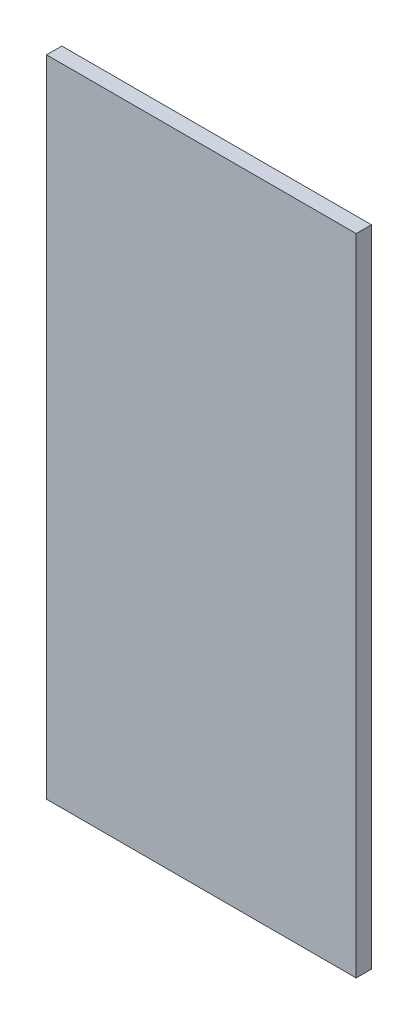
ISO-10303-21;
HEADER;
FILE_DESCRIPTION(('STEP AP214'),'2;1');
FILE_NAME('part.step','',(''),(''),'','','');
FILE_SCHEMA(('AUTOMOTIVE_DESIGN { 1 0 10303 214 1 1 1 1 }'));
ENDSEC;
DATA;
#1=APPLICATION_CONTEXT('core data for automotive mechanical design processes');
#2=APPLICATION_PROTOCOL_DEFINITION('international standard','automotive_design',2000,#1);
#3=PRODUCT_CONTEXT('',#1,'mechanical');
#4=PRODUCT('Part','Part','',(#3));
#5=PRODUCT_RELATED_PRODUCT_CATEGORY('part','',(#4));
#6=PRODUCT_DEFINITION_FORMATION('','',#4);
#7=PRODUCT_DEFINITION_CONTEXT('part definition',#1,'design');
#8=PRODUCT_DEFINITION('design','',#6,#7);
#9=PRODUCT_DEFINITION_SHAPE('','',#8);
#10=(LENGTH_UNIT() NAMED_UNIT(*) SI_UNIT(.MILLI.,.METRE.));
#11=(NAMED_UNIT(*) PLANE_ANGLE_UNIT() SI_UNIT($,.RADIAN.));
#12=(NAMED_UNIT(*) SI_UNIT($,.STERADIAN.) SOLID_ANGLE_UNIT());
#13=UNCERTAINTY_MEASURE_WITH_UNIT(LENGTH_MEASURE(1.E-05),#10,'distance_accuracy_value','');
#14=(GEOMETRIC_REPRESENTATION_CONTEXT(3) GLOBAL_UNCERTAINTY_ASSIGNED_CONTEXT((#13)) GLOBAL_UNIT_ASSIGNED_CONTEXT((#10,
#11,#12)) REPRESENTATION_CONTEXT('',''));
#15=CARTESIAN_POINT('',(0.,0.,0.));
#16=DIRECTION('',(0.,0.,1.));
#17=DIRECTION('',(1.,0.,0.));
#18=AXIS2_PLACEMENT_3D('',#15,#16,#17);
#19=CARTESIAN_POINT('',(-182.5,-380.,18.));
#20=DIRECTION('',(1.,0.,0.));
#21=DIRECTION('',(0.,0.,-1.));
#22=AXIS2_PLACEMENT_3D('',#19,#20,#21);
#23=PLANE('',#22);
#24=DIRECTION('',(0.,-1.,0.));
#25=VECTOR('',#24,1.);
#26=CARTESIAN_POINT('',(-182.5,-380.,0.));
#27=LINE('',#26,#25);
#28=CARTESIAN_POINT('',(-182.5,380.,0.));
#29=VERTEX_POINT('',#28);
#30=CARTESIAN_POINT('',(-182.5,-380.,0.));
#31=VERTEX_POINT('',#30);
#32=EDGE_CURVE('E96',#29,#31,#27,.T.);
#33=ORIENTED_EDGE('',*,*,#32,.T.);
#34=DIRECTION('',(0.,0.,-1.));
#35=VECTOR('',#34,1.);
#36=CARTESIAN_POINT('',(-182.5,-380.,18.));
#37=LINE('',#36,#35);
#38=CARTESIAN_POINT('',(-182.5,-380.,18.));
#39=VERTEX_POINT('',#38);
#40=EDGE_CURVE('E11',#39,#31,#37,.T.);
#41=ORIENTED_EDGE('',*,*,#40,.F.);
#42=DIRECTION('',(0.,-1.,0.));
#43=VECTOR('',#42,1.);
#44=CARTESIAN_POINT('',(-182.5,-380.,18.));
#45=LINE('',#44,#43);
#46=CARTESIAN_POINT('',(-182.5,380.,18.));
#47=VERTEX_POINT('',#46);
#48=EDGE_CURVE('E84',#47,#39,#45,.T.);
#49=ORIENTED_EDGE('',*,*,#48,.F.);
#50=DIRECTION('',(0.,0.,-1.));
#51=VECTOR('',#50,1.);
#52=CARTESIAN_POINT('',(-182.5,380.,18.));
#53=LINE('',#52,#51);
#54=EDGE_CURVE('E92',#47,#29,#53,.T.);
#55=ORIENTED_EDGE('',*,*,#54,.T.);
#56=EDGE_LOOP('',(#33,#41,#49,#55));
#57=FACE_BOUND('',#56,.T.);
#58=ADVANCED_FACE('F33',(#57),#23,.F.);
#59=CARTESIAN_POINT('',(182.5,-380.,18.));
#60=DIRECTION('',(0.,1.,0.));
#61=DIRECTION('',(0.,0.,1.));
#62=AXIS2_PLACEMENT_3D('',#59,#60,#61);
#63=PLANE('',#62);
#64=DIRECTION('',(1.,0.,0.));
#65=VECTOR('',#64,1.);
#66=CARTESIAN_POINT('',(182.5,-380.,0.));
#67=LINE('',#66,#65);
#68=CARTESIAN_POINT('',(182.5,-380.,0.));
#69=VERTEX_POINT('',#68);
#70=EDGE_CURVE('E88',#31,#69,#67,.T.);
#71=ORIENTED_EDGE('',*,*,#70,.T.);
#72=DIRECTION('',(0.,0.,-1.));
#73=VECTOR('',#72,1.);
#74=CARTESIAN_POINT('',(182.5,-380.,18.));
#75=LINE('',#74,#73);
#76=CARTESIAN_POINT('',(182.5,-380.,18.));
#77=VERTEX_POINT('',#76);
#78=EDGE_CURVE('E41',#77,#69,#75,.T.);
#79=ORIENTED_EDGE('',*,*,#78,.F.);
#80=DIRECTION('',(1.,0.,0.));
#81=VECTOR('',#80,1.);
#82=CARTESIAN_POINT('',(182.5,-380.,18.));
#83=LINE('',#82,#81);
#84=EDGE_CURVE('E79',#39,#77,#83,.T.);
#85=ORIENTED_EDGE('',*,*,#84,.F.);
#86=ORIENTED_EDGE('',*,*,#40,.T.);
#87=EDGE_LOOP('',(#71,#79,#85,#86));
#88=FACE_BOUND('',#87,.T.);
#89=ADVANCED_FACE('F87',(#88),#63,.F.);
#90=CARTESIAN_POINT('',(182.5,-380.,18.));
#91=DIRECTION('',(-1.,0.,0.));
#92=DIRECTION('',(0.,0.,1.));
#93=AXIS2_PLACEMENT_3D('',#90,#91,#92);
#94=PLANE('',#93);
#95=DIRECTION('',(0.,1.,0.));
#96=VECTOR('',#95,1.);
#97=CARTESIAN_POINT('',(182.5,-380.,0.));
#98=LINE('',#97,#96);
#99=CARTESIAN_POINT('',(182.5,380.,0.));
#100=VERTEX_POINT('',#99);
#101=EDGE_CURVE('E66',#69,#100,#98,.T.);
#102=ORIENTED_EDGE('',*,*,#101,.T.);
#103=DIRECTION('',(0.,0.,-1.));
#104=VECTOR('',#103,1.);
#105=CARTESIAN_POINT('',(182.5,380.,18.));
#106=LINE('',#105,#104);
#107=CARTESIAN_POINT('',(182.5,380.,18.));
#108=VERTEX_POINT('',#107);
#109=EDGE_CURVE('E89',#108,#100,#106,.T.);
#110=ORIENTED_EDGE('',*,*,#109,.F.);
#111=DIRECTION('',(0.,1.,0.));
#112=VECTOR('',#111,1.);
#113=CARTESIAN_POINT('',(182.5,-380.,18.));
#114=LINE('',#113,#112);
#115=EDGE_CURVE('E82',#77,#108,#114,.T.);
#116=ORIENTED_EDGE('',*,*,#115,.F.);
#117=ORIENTED_EDGE('',*,*,#78,.T.);
#118=EDGE_LOOP('',(#102,#110,#116,#117));
#119=FACE_BOUND('',#118,.T.);
#120=ADVANCED_FACE('F90',(#119),#94,.F.);
#121=CARTESIAN_POINT('',(182.5,380.,18.));
#122=DIRECTION('',(0.,-1.,0.));
#123=DIRECTION('',(1.,0.,0.));
#124=AXIS2_PLACEMENT_3D('',#121,#122,#123);
#125=PLANE('',#124);
#126=DIRECTION('',(-1.,0.,0.));
#127=VECTOR('',#126,1.);
#128=CARTESIAN_POINT('',(182.5,380.,0.));
#129=LINE('',#128,#127);
#130=EDGE_CURVE('E72',#100,#29,#129,.T.);
#131=ORIENTED_EDGE('',*,*,#130,.T.);
#132=ORIENTED_EDGE('',*,*,#54,.F.);
#133=DIRECTION('',(-1.,0.,0.));
#134=VECTOR('',#133,1.);
#135=CARTESIAN_POINT('',(182.5,380.,18.));
#136=LINE('',#135,#134);
#137=EDGE_CURVE('E49',#108,#47,#136,.T.);
#138=ORIENTED_EDGE('',*,*,#137,.F.);
#139=ORIENTED_EDGE('',*,*,#109,.T.);
#140=EDGE_LOOP('',(#131,#132,#138,#139));
#141=FACE_BOUND('',#140,.T.);
#142=ADVANCED_FACE('F103',(#141),#125,.F.);
#143=CARTESIAN_POINT('',(0.,0.,18.));
#144=DIRECTION('',(0.,0.,1.));
#145=DIRECTION('',(1.,0.,0.));
#146=AXIS2_PLACEMENT_3D('',#143,#144,#145);
#147=PLANE('',#146);
#148=ORIENTED_EDGE('',*,*,#48,.T.);
#149=ORIENTED_EDGE('',*,*,#84,.T.);
#150=ORIENTED_EDGE('',*,*,#115,.T.);
#151=ORIENTED_EDGE('',*,*,#137,.T.);
#152=EDGE_LOOP('',(#148,#149,#150,#151));
#153=FACE_BOUND('',#152,.T.);
#154=ADVANCED_FACE('F80',(#153),#147,.T.);
#155=CARTESIAN_POINT('',(0.,0.,0.));
#156=DIRECTION('',(0.,0.,1.));
#157=DIRECTION('',(1.,0.,0.));
#158=AXIS2_PLACEMENT_3D('',#155,#156,#157);
#159=PLANE('',#158);
#160=ORIENTED_EDGE('',*,*,#32,.F.);
#161=ORIENTED_EDGE('',*,*,#130,.F.);
#162=ORIENTED_EDGE('',*,*,#101,.F.);
#163=ORIENTED_EDGE('',*,*,#70,.F.);
#164=EDGE_LOOP('',(#160,#161,#162,#163));
#165=FACE_BOUND('',#164,.T.);
#166=ADVANCED_FACE('F106',(#165),#159,.F.);
#167=CLOSED_SHELL('',(#58,#89,#120,#142,#154,#166));
#168=MANIFOLD_SOLID_BREP('B2',#167);
#169=ADVANCED_BREP_SHAPE_REPRESENTATION('',(#18,#168),#14);
#170=SHAPE_DEFINITION_REPRESENTATION(#9,#169);
ENDSEC;
END-ISO-10303-21;
